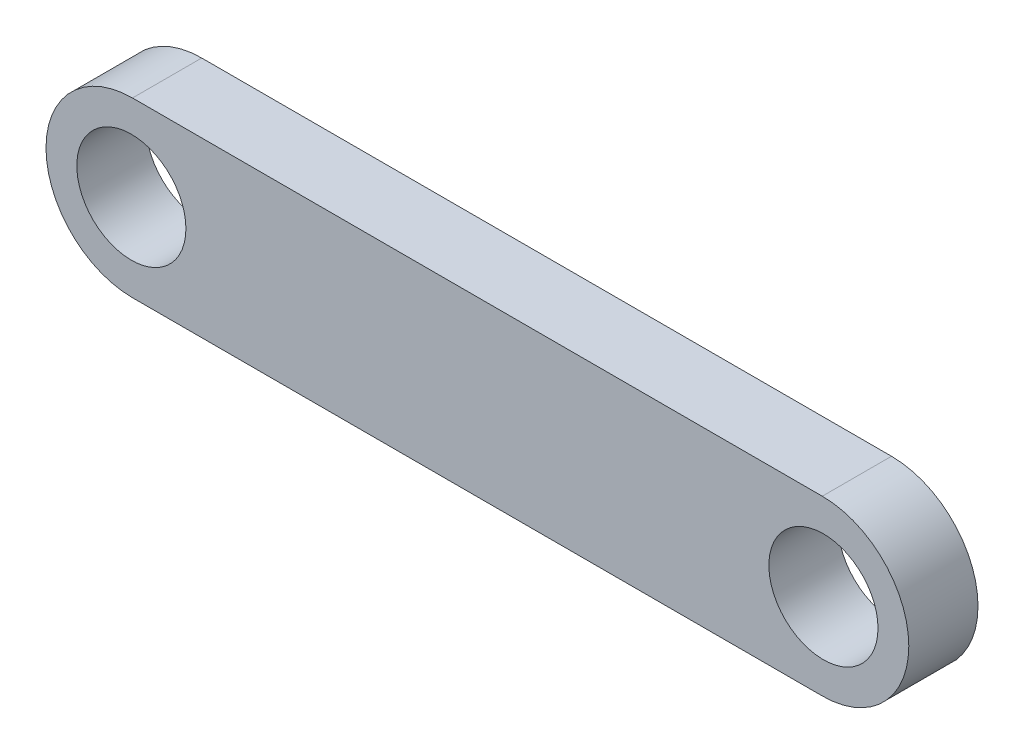
ISO-10303-21;
HEADER;
FILE_DESCRIPTION(('STEP AP214'),'2;1');
FILE_NAME('part.step','',(''),(''),'','','');
FILE_SCHEMA(('AUTOMOTIVE_DESIGN { 1 0 10303 214 1 1 1 1 }'));
ENDSEC;
DATA;
#1=APPLICATION_CONTEXT('core data for automotive mechanical design processes');
#2=APPLICATION_PROTOCOL_DEFINITION('international standard','automotive_design',2000,#1);
#3=PRODUCT_CONTEXT('',#1,'mechanical');
#4=PRODUCT('Part','Part','',(#3));
#5=PRODUCT_RELATED_PRODUCT_CATEGORY('part','',(#4));
#6=PRODUCT_DEFINITION_FORMATION('','',#4);
#7=PRODUCT_DEFINITION_CONTEXT('part definition',#1,'design');
#8=PRODUCT_DEFINITION('design','',#6,#7);
#9=PRODUCT_DEFINITION_SHAPE('','',#8);
#10=(LENGTH_UNIT() NAMED_UNIT(*) SI_UNIT(.MILLI.,.METRE.));
#11=(NAMED_UNIT(*) PLANE_ANGLE_UNIT() SI_UNIT($,.RADIAN.));
#12=(NAMED_UNIT(*) SI_UNIT($,.STERADIAN.) SOLID_ANGLE_UNIT());
#13=UNCERTAINTY_MEASURE_WITH_UNIT(LENGTH_MEASURE(1.E-05),#10,'distance_accuracy_value','');
#14=(GEOMETRIC_REPRESENTATION_CONTEXT(3) GLOBAL_UNCERTAINTY_ASSIGNED_CONTEXT((#13)) GLOBAL_UNIT_ASSIGNED_CONTEXT((#10,
#11,#12)) REPRESENTATION_CONTEXT('',''));
#15=CARTESIAN_POINT('',(0.,0.,0.));
#16=DIRECTION('',(0.,0.,1.));
#17=DIRECTION('',(1.,0.,0.));
#18=AXIS2_PLACEMENT_3D('',#15,#16,#17);
#19=CARTESIAN_POINT('',(0.0500000000000014,-3.75,-38.1445933259224));
#20=DIRECTION('',(0.,-1.,0.));
#21=DIRECTION('',(0.,0.,-1.));
#22=AXIS2_PLACEMENT_3D('',#19,#20,#21);
#23=PLANE('',#22);
#24=DIRECTION('',(-1.,0.,0.));
#25=VECTOR('',#24,1.);
#26=CARTESIAN_POINT('',(0.0500000000000014,-3.75,0.));
#27=LINE('',#26,#25);
#28=CARTESIAN_POINT('',(29.95,-3.75,0.));
#29=VERTEX_POINT('',#28);
#30=CARTESIAN_POINT('',(0.0500000000000014,-3.75,0.));
#31=VERTEX_POINT('',#30);
#32=EDGE_CURVE('E121',#29,#31,#27,.T.);
#33=ORIENTED_EDGE('',*,*,#32,.F.);
#34=DIRECTION('',(0.,0.,1.));
#35=VECTOR('',#34,1.);
#36=CARTESIAN_POINT('',(29.95,-3.75,-38.1445933259224));
#37=LINE('',#36,#35);
#38=CARTESIAN_POINT('',(29.95,-3.75,3.));
#39=VERTEX_POINT('',#38);
#40=EDGE_CURVE('E87',#29,#39,#37,.T.);
#41=ORIENTED_EDGE('',*,*,#40,.T.);
#42=DIRECTION('',(1.,0.,0.));
#43=VECTOR('',#42,1.);
#44=CARTESIAN_POINT('',(0.0500000000000014,-3.75,3.));
#45=LINE('',#44,#43);
#46=CARTESIAN_POINT('',(0.0500000000000014,-3.75,3.));
#47=VERTEX_POINT('',#46);
#48=EDGE_CURVE('E90',#47,#39,#45,.T.);
#49=ORIENTED_EDGE('',*,*,#48,.F.);
#50=DIRECTION('',(0.,0.,1.));
#51=VECTOR('',#50,1.);
#52=CARTESIAN_POINT('',(0.0500000000000014,-3.75,-38.1445933259224));
#53=LINE('',#52,#51);
#54=EDGE_CURVE('E78',#31,#47,#53,.T.);
#55=ORIENTED_EDGE('',*,*,#54,.F.);
#56=EDGE_LOOP('',(#33,#41,#49,#55));
#57=FACE_BOUND('',#56,.T.);
#58=ADVANCED_FACE('F40',(#57),#23,.T.);
#59=CARTESIAN_POINT('',(29.95,0.,-38.1445933259224));
#60=DIRECTION('',(0.,0.,1.));
#61=DIRECTION('',(1.,0.,0.));
#62=AXIS2_PLACEMENT_3D('',#59,#60,#61);
#63=CYLINDRICAL_SURFACE('',#62,3.75);
#64=CARTESIAN_POINT('',(29.95,0.,0.));
#65=DIRECTION('',(0.,0.,1.));
#66=DIRECTION('',(1.,0.,0.));
#67=AXIS2_PLACEMENT_3D('',#64,#65,#66);
#68=CIRCLE('',#67,3.75);
#69=CARTESIAN_POINT('',(29.95,3.75,0.));
#70=VERTEX_POINT('',#69);
#71=EDGE_CURVE('E110',#70,#29,#68,.F.);
#72=ORIENTED_EDGE('',*,*,#71,.F.);
#73=DIRECTION('',(0.,0.,1.));
#74=VECTOR('',#73,1.);
#75=CARTESIAN_POINT('',(29.95,3.75,-38.1445933259224));
#76=LINE('',#75,#74);
#77=CARTESIAN_POINT('',(29.95,3.75,3.));
#78=VERTEX_POINT('',#77);
#79=EDGE_CURVE('E111',#70,#78,#76,.T.);
#80=ORIENTED_EDGE('',*,*,#79,.T.);
#81=CARTESIAN_POINT('',(29.95,0.,3.));
#82=DIRECTION('',(0.,0.,1.));
#83=DIRECTION('',(1.,0.,0.));
#84=AXIS2_PLACEMENT_3D('',#81,#82,#83);
#85=CIRCLE('',#84,3.75);
#86=EDGE_CURVE('E95',#39,#78,#85,.T.);
#87=ORIENTED_EDGE('',*,*,#86,.F.);
#88=ORIENTED_EDGE('',*,*,#40,.F.);
#89=EDGE_LOOP('',(#72,#80,#87,#88));
#90=FACE_BOUND('',#89,.T.);
#91=ADVANCED_FACE('F116',(#90),#63,.T.);
#92=CARTESIAN_POINT('',(0.0499999999999992,3.75,-38.1445933259224));
#93=DIRECTION('',(0.,1.,0.));
#94=DIRECTION('',(0.,0.,1.));
#95=AXIS2_PLACEMENT_3D('',#92,#93,#94);
#96=PLANE('',#95);
#97=DIRECTION('',(1.,0.,0.));
#98=VECTOR('',#97,1.);
#99=CARTESIAN_POINT('',(0.0499999999999992,3.75,0.));
#100=LINE('',#99,#98);
#101=CARTESIAN_POINT('',(0.0499999999999992,3.75,0.));
#102=VERTEX_POINT('',#101);
#103=EDGE_CURVE('E119',#102,#70,#100,.T.);
#104=ORIENTED_EDGE('',*,*,#103,.F.);
#105=DIRECTION('',(0.,0.,1.));
#106=VECTOR('',#105,1.);
#107=CARTESIAN_POINT('',(0.0499999999999992,3.75,-38.1445933259224));
#108=LINE('',#107,#106);
#109=CARTESIAN_POINT('',(0.0499999999999992,3.75,3.));
#110=VERTEX_POINT('',#109);
#111=EDGE_CURVE('E108',#102,#110,#108,.T.);
#112=ORIENTED_EDGE('',*,*,#111,.T.);
#113=DIRECTION('',(-1.,0.,0.));
#114=VECTOR('',#113,1.);
#115=CARTESIAN_POINT('',(0.0499999999999992,3.75,3.));
#116=LINE('',#115,#114);
#117=EDGE_CURVE('E88',#78,#110,#116,.T.);
#118=ORIENTED_EDGE('',*,*,#117,.F.);
#119=ORIENTED_EDGE('',*,*,#79,.F.);
#120=EDGE_LOOP('',(#104,#112,#118,#119));
#121=FACE_BOUND('',#120,.T.);
#122=ADVANCED_FACE('F118',(#121),#96,.T.);
#123=CARTESIAN_POINT('',(0.0499999999999992,0.,-38.1445933259224));
#124=DIRECTION('',(0.,0.,1.));
#125=DIRECTION('',(1.,0.,0.));
#126=AXIS2_PLACEMENT_3D('',#123,#124,#125);
#127=CYLINDRICAL_SURFACE('',#126,3.75);
#128=CARTESIAN_POINT('',(0.0499999999999992,0.,0.));
#129=DIRECTION('',(0.,0.,1.));
#130=DIRECTION('',(1.,0.,0.));
#131=AXIS2_PLACEMENT_3D('',#128,#129,#130);
#132=CIRCLE('',#131,3.75);
#133=EDGE_CURVE('E58',#31,#102,#132,.F.);
#134=ORIENTED_EDGE('',*,*,#133,.F.);
#135=ORIENTED_EDGE('',*,*,#54,.T.);
#136=CARTESIAN_POINT('',(0.0499999999999992,0.,3.));
#137=DIRECTION('',(0.,0.,1.));
#138=DIRECTION('',(1.,0.,0.));
#139=AXIS2_PLACEMENT_3D('',#136,#137,#138);
#140=CIRCLE('',#139,3.75);
#141=EDGE_CURVE('E83',#110,#47,#140,.T.);
#142=ORIENTED_EDGE('',*,*,#141,.F.);
#143=ORIENTED_EDGE('',*,*,#111,.F.);
#144=EDGE_LOOP('',(#134,#135,#142,#143));
#145=FACE_BOUND('',#144,.T.);
#146=ADVANCED_FACE('F80',(#145),#127,.T.);
#147=CARTESIAN_POINT('',(0.,0.,0.));
#148=DIRECTION('',(0.,0.,1.));
#149=DIRECTION('',(1.,0.,0.));
#150=AXIS2_PLACEMENT_3D('',#147,#148,#149);
#151=PLANE('',#150);
#152=CARTESIAN_POINT('',(30.,0.,0.));
#153=DIRECTION('',(0.,0.,1.));
#154=DIRECTION('',(1.,0.,0.));
#155=AXIS2_PLACEMENT_3D('',#152,#153,#154);
#156=CIRCLE('',#155,2.365);
#157=CARTESIAN_POINT('',(32.365,0.,0.));
#158=VERTEX_POINT('',#157);
#159=EDGE_CURVE('E44',#158,#158,#156,.F.);
#160=ORIENTED_EDGE('',*,*,#159,.F.);
#161=EDGE_LOOP('',(#160));
#162=FACE_BOUND('',#161,.T.);
#163=CARTESIAN_POINT('',(0.,0.,0.));
#164=DIRECTION('',(0.,0.,1.));
#165=DIRECTION('',(1.,0.,0.));
#166=AXIS2_PLACEMENT_3D('',#163,#164,#165);
#167=CIRCLE('',#166,2.365);
#168=CARTESIAN_POINT('',(2.365,0.,0.));
#169=VERTEX_POINT('',#168);
#170=EDGE_CURVE('E11',#169,#169,#167,.F.);
#171=ORIENTED_EDGE('',*,*,#170,.F.);
#172=EDGE_LOOP('',(#171));
#173=FACE_BOUND('',#172,.T.);
#174=ORIENTED_EDGE('',*,*,#133,.T.);
#175=ORIENTED_EDGE('',*,*,#103,.T.);
#176=ORIENTED_EDGE('',*,*,#71,.T.);
#177=ORIENTED_EDGE('',*,*,#32,.T.);
#178=EDGE_LOOP('',(#174,#175,#176,#177));
#179=FACE_BOUND('',#178,.T.);
#180=ADVANCED_FACE('F42',(#162,#173,#179),#151,.F.);
#181=CARTESIAN_POINT('',(30.,0.,-38.1445933259224));
#182=DIRECTION('',(0.,0.,1.));
#183=DIRECTION('',(1.,0.,0.));
#184=AXIS2_PLACEMENT_3D('',#181,#182,#183);
#185=CYLINDRICAL_SURFACE('',#184,2.365);
#186=ORIENTED_EDGE('',*,*,#159,.T.);
#187=EDGE_LOOP('',(#186));
#188=FACE_BOUND('',#187,.T.);
#189=CARTESIAN_POINT('',(30.,0.,3.));
#190=DIRECTION('',(0.,0.,1.));
#191=DIRECTION('',(1.,0.,0.));
#192=AXIS2_PLACEMENT_3D('',#189,#190,#191);
#193=CIRCLE('',#192,2.365);
#194=CARTESIAN_POINT('',(32.365,0.,3.));
#195=VERTEX_POINT('',#194);
#196=EDGE_CURVE('E102',#195,#195,#193,.T.);
#197=ORIENTED_EDGE('',*,*,#196,.T.);
#198=EDGE_LOOP('',(#197));
#199=FACE_BOUND('',#198,.T.);
#200=ADVANCED_FACE('F128',(#188,#199),#185,.F.);
#201=CARTESIAN_POINT('',(0.,0.,3.));
#202=DIRECTION('',(0.,0.,1.));
#203=DIRECTION('',(1.,0.,0.));
#204=AXIS2_PLACEMENT_3D('',#201,#202,#203);
#205=PLANE('',#204);
#206=ORIENTED_EDGE('',*,*,#196,.F.);
#207=EDGE_LOOP('',(#206));
#208=FACE_BOUND('',#207,.T.);
#209=CARTESIAN_POINT('',(0.,0.,3.));
#210=DIRECTION('',(0.,0.,1.));
#211=DIRECTION('',(1.,0.,0.));
#212=AXIS2_PLACEMENT_3D('',#209,#210,#211);
#213=CIRCLE('',#212,2.365);
#214=CARTESIAN_POINT('',(2.365,0.,3.));
#215=VERTEX_POINT('',#214);
#216=EDGE_CURVE('E99',#215,#215,#213,.T.);
#217=ORIENTED_EDGE('',*,*,#216,.F.);
#218=EDGE_LOOP('',(#217));
#219=FACE_BOUND('',#218,.T.);
#220=ORIENTED_EDGE('',*,*,#141,.T.);
#221=ORIENTED_EDGE('',*,*,#48,.T.);
#222=ORIENTED_EDGE('',*,*,#86,.T.);
#223=ORIENTED_EDGE('',*,*,#117,.T.);
#224=EDGE_LOOP('',(#220,#221,#222,#223));
#225=FACE_BOUND('',#224,.T.);
#226=ADVANCED_FACE('F97',(#208,#219,#225),#205,.T.);
#227=CARTESIAN_POINT('',(0.,0.,-38.1445933259224));
#228=DIRECTION('',(0.,0.,1.));
#229=DIRECTION('',(1.,0.,0.));
#230=AXIS2_PLACEMENT_3D('',#227,#228,#229);
#231=CYLINDRICAL_SURFACE('',#230,2.365);
#232=ORIENTED_EDGE('',*,*,#170,.T.);
#233=EDGE_LOOP('',(#232));
#234=FACE_BOUND('',#233,.T.);
#235=ORIENTED_EDGE('',*,*,#216,.T.);
#236=EDGE_LOOP('',(#235));
#237=FACE_BOUND('',#236,.T.);
#238=ADVANCED_FACE('F132',(#234,#237),#231,.F.);
#239=CLOSED_SHELL('',(#58,#91,#122,#146,#180,#200,#226,#238));
#240=MANIFOLD_SOLID_BREP('B2',#239);
#241=ADVANCED_BREP_SHAPE_REPRESENTATION('',(#18,#240),#14);
#242=SHAPE_DEFINITION_REPRESENTATION(#9,#241);
ENDSEC;
END-ISO-10303-21;
